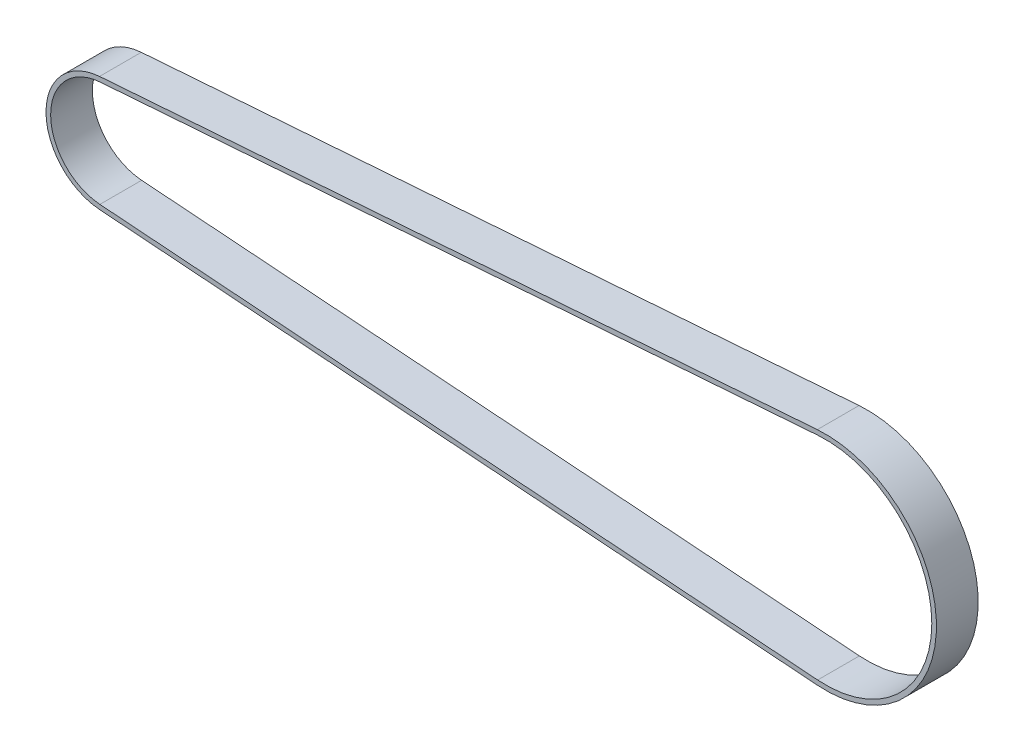
ISO-10303-21;
HEADER;
FILE_DESCRIPTION(('STEP AP214'),'2;1');
FILE_NAME('part.step','',(''),(''),'','','');
FILE_SCHEMA(('AUTOMOTIVE_DESIGN { 1 0 10303 214 1 1 1 1 }'));
ENDSEC;
DATA;
#1=APPLICATION_CONTEXT('core data for automotive mechanical design processes');
#2=APPLICATION_PROTOCOL_DEFINITION('international standard','automotive_design',2000,#1);
#3=PRODUCT_CONTEXT('',#1,'mechanical');
#4=PRODUCT('Part','Part','',(#3));
#5=PRODUCT_RELATED_PRODUCT_CATEGORY('part','',(#4));
#6=PRODUCT_DEFINITION_FORMATION('','',#4);
#7=PRODUCT_DEFINITION_CONTEXT('part definition',#1,'design');
#8=PRODUCT_DEFINITION('design','',#6,#7);
#9=PRODUCT_DEFINITION_SHAPE('','',#8);
#10=(LENGTH_UNIT() NAMED_UNIT(*) SI_UNIT(.MILLI.,.METRE.));
#11=(NAMED_UNIT(*) PLANE_ANGLE_UNIT() SI_UNIT($,.RADIAN.));
#12=(NAMED_UNIT(*) SI_UNIT($,.STERADIAN.) SOLID_ANGLE_UNIT());
#13=UNCERTAINTY_MEASURE_WITH_UNIT(LENGTH_MEASURE(1.E-05),#10,'distance_accuracy_value','');
#14=(GEOMETRIC_REPRESENTATION_CONTEXT(3) GLOBAL_UNCERTAINTY_ASSIGNED_CONTEXT((#13)) GLOBAL_UNIT_ASSIGNED_CONTEXT((#10,
#11,#12)) REPRESENTATION_CONTEXT('',''));
#15=CARTESIAN_POINT('',(0.,0.,0.));
#16=DIRECTION('',(0.,0.,1.));
#17=DIRECTION('',(1.,0.,0.));
#18=AXIS2_PLACEMENT_3D('',#15,#16,#17);
#19=CARTESIAN_POINT('',(-77.7888970641995,0.,9.));
#20=DIRECTION('',(0.,0.,1.));
#21=DIRECTION('',(1.,0.,0.));
#22=AXIS2_PLACEMENT_3D('',#19,#20,#21);
#23=PLANE('',#22);
#24=CARTESIAN_POINT('',(-77.7888970641995,0.,9.));
#25=DIRECTION('',(0.,0.,1.));
#26=DIRECTION('',(1.,0.,0.));
#27=AXIS2_PLACEMENT_3D('',#24,#25,#26);
#28=CIRCLE('',#27,12.4591559026165);
#29=CARTESIAN_POINT('',(-78.7065820764015,12.4253136791021,9.));
#30=VERTEX_POINT('',#29);
#31=CARTESIAN_POINT('',(-78.7065820764015,-12.4253136791021,9.));
#32=VERTEX_POINT('',#31);
#33=EDGE_CURVE('E134',#30,#32,#28,.T.);
#34=ORIENTED_EDGE('',*,*,#33,.T.);
#35=DIRECTION('',(0.997283746685662,-0.0736554722787699,0.));
#36=VECTOR('',#35,1.);
#37=CARTESIAN_POINT('',(76.0271825120742,-23.8533436115186,9.));
#38=LINE('',#37,#36);
#39=CARTESIAN_POINT('',(76.0271825120742,-23.8533436115186,9.));
#40=VERTEX_POINT('',#39);
#41=EDGE_CURVE('E137',#32,#40,#38,.T.);
#42=ORIENTED_EDGE('',*,*,#41,.T.);
#43=CARTESIAN_POINT('',(77.7888970641995,0.,9.));
#44=DIRECTION('',(0.,0.,1.));
#45=DIRECTION('',(1.,0.,0.));
#46=AXIS2_PLACEMENT_3D('',#43,#44,#45);
#47=CIRCLE('',#46,23.9183118052329);
#48=CARTESIAN_POINT('',(76.0271825120742,23.8533436115186,9.));
#49=VERTEX_POINT('',#48);
#50=EDGE_CURVE('E140',#40,#49,#47,.T.);
#51=ORIENTED_EDGE('',*,*,#50,.T.);
#52=DIRECTION('',(-0.997283746685662,-0.0736554722787699,0.));
#53=VECTOR('',#52,1.);
#54=CARTESIAN_POINT('',(-78.7065820764015,12.4253136791021,9.));
#55=LINE('',#54,#53);
#56=EDGE_CURVE('E142',#49,#30,#55,.T.);
#57=ORIENTED_EDGE('',*,*,#56,.T.);
#58=EDGE_LOOP('',(#34,#42,#51,#57));
#59=FACE_BOUND('',#58,.T.);
#60=DIRECTION('',(0.997283746685662,-0.0736554722787699,0.));
#61=VECTOR('',#60,1.);
#62=CARTESIAN_POINT('',(76.100837984353,-22.8560598648329,9.));
#63=LINE('',#62,#61);
#64=CARTESIAN_POINT('',(-78.6329266041228,-11.4280299324165,9.));
#65=VERTEX_POINT('',#64);
#66=CARTESIAN_POINT('',(76.1008379843529,-22.8560598648329,9.));
#67=VERTEX_POINT('',#66);
#68=EDGE_CURVE('E106',#65,#67,#63,.T.);
#69=ORIENTED_EDGE('',*,*,#68,.F.);
#70=CARTESIAN_POINT('',(-77.7888970641995,0.,9.));
#71=DIRECTION('',(0.,0.,1.));
#72=DIRECTION('',(1.,0.,0.));
#73=AXIS2_PLACEMENT_3D('',#70,#71,#72);
#74=CIRCLE('',#73,11.4591559026165);
#75=CARTESIAN_POINT('',(-78.6329266041228,11.4280299324165,9.));
#76=VERTEX_POINT('',#75);
#77=EDGE_CURVE('E98',#76,#65,#74,.T.);
#78=ORIENTED_EDGE('',*,*,#77,.F.);
#79=DIRECTION('',(-0.997283746685662,-0.0736554722787699,0.));
#80=VECTOR('',#79,1.);
#81=CARTESIAN_POINT('',(-78.6329266041228,11.4280299324165,9.));
#82=LINE('',#81,#80);
#83=CARTESIAN_POINT('',(76.1008379843529,22.8560598648329,9.));
#84=VERTEX_POINT('',#83);
#85=EDGE_CURVE('E120',#84,#76,#82,.T.);
#86=ORIENTED_EDGE('',*,*,#85,.F.);
#87=CARTESIAN_POINT('',(77.7888970641995,0.,9.));
#88=DIRECTION('',(0.,0.,1.));
#89=DIRECTION('',(1.,0.,0.));
#90=AXIS2_PLACEMENT_3D('',#87,#88,#89);
#91=CIRCLE('',#90,22.9183118052329);
#92=EDGE_CURVE('E118',#67,#84,#91,.T.);
#93=ORIENTED_EDGE('',*,*,#92,.F.);
#94=EDGE_LOOP('',(#69,#78,#86,#93));
#95=FACE_BOUND('',#94,.T.);
#96=ADVANCED_FACE('F33',(#59,#95),#23,.T.);
#97=CARTESIAN_POINT('',(-77.7888970641995,0.,0.));
#98=DIRECTION('',(0.,0.,1.));
#99=DIRECTION('',(1.,0.,0.));
#100=AXIS2_PLACEMENT_3D('',#97,#98,#99);
#101=PLANE('',#100);
#102=CARTESIAN_POINT('',(-77.7888970641995,0.,0.));
#103=DIRECTION('',(0.,0.,1.));
#104=DIRECTION('',(1.,0.,0.));
#105=AXIS2_PLACEMENT_3D('',#102,#103,#104);
#106=CIRCLE('',#105,12.4591559026165);
#107=CARTESIAN_POINT('',(-78.7065820764015,12.4253136791021,0.));
#108=VERTEX_POINT('',#107);
#109=CARTESIAN_POINT('',(-78.7065820764015,-12.4253136791021,0.));
#110=VERTEX_POINT('',#109);
#111=EDGE_CURVE('E114',#108,#110,#106,.T.);
#112=ORIENTED_EDGE('',*,*,#111,.F.);
#113=DIRECTION('',(-0.997283746685662,-0.0736554722787699,0.));
#114=VECTOR('',#113,1.);
#115=CARTESIAN_POINT('',(-78.7065820764015,12.4253136791021,0.));
#116=LINE('',#115,#114);
#117=CARTESIAN_POINT('',(76.0271825120742,23.8533436115186,0.));
#118=VERTEX_POINT('',#117);
#119=EDGE_CURVE('E138',#118,#108,#116,.T.);
#120=ORIENTED_EDGE('',*,*,#119,.F.);
#121=CARTESIAN_POINT('',(77.7888970641995,0.,0.));
#122=DIRECTION('',(0.,0.,1.));
#123=DIRECTION('',(1.,0.,0.));
#124=AXIS2_PLACEMENT_3D('',#121,#122,#123);
#125=CIRCLE('',#124,23.9183118052329);
#126=CARTESIAN_POINT('',(76.0271825120742,-23.8533436115186,0.));
#127=VERTEX_POINT('',#126);
#128=EDGE_CURVE('E149',#127,#118,#125,.T.);
#129=ORIENTED_EDGE('',*,*,#128,.F.);
#130=DIRECTION('',(0.997283746685662,-0.0736554722787699,0.));
#131=VECTOR('',#130,1.);
#132=CARTESIAN_POINT('',(76.0271825120742,-23.8533436115186,0.));
#133=LINE('',#132,#131);
#134=EDGE_CURVE('E147',#110,#127,#133,.T.);
#135=ORIENTED_EDGE('',*,*,#134,.F.);
#136=EDGE_LOOP('',(#112,#120,#129,#135));
#137=FACE_BOUND('',#136,.T.);
#138=CARTESIAN_POINT('',(-77.7888970641995,0.,0.));
#139=DIRECTION('',(0.,0.,1.));
#140=DIRECTION('',(1.,0.,0.));
#141=AXIS2_PLACEMENT_3D('',#138,#139,#140);
#142=CIRCLE('',#141,11.4591559026165);
#143=CARTESIAN_POINT('',(-78.6329266041228,11.4280299324165,0.));
#144=VERTEX_POINT('',#143);
#145=CARTESIAN_POINT('',(-78.6329266041228,-11.4280299324165,0.));
#146=VERTEX_POINT('',#145);
#147=EDGE_CURVE('E56',#144,#146,#142,.T.);
#148=ORIENTED_EDGE('',*,*,#147,.T.);
#149=DIRECTION('',(0.997283746685662,-0.0736554722787699,0.));
#150=VECTOR('',#149,1.);
#151=CARTESIAN_POINT('',(76.100837984353,-22.8560598648329,0.));
#152=LINE('',#151,#150);
#153=CARTESIAN_POINT('',(76.1008379843529,-22.8560598648329,0.));
#154=VERTEX_POINT('',#153);
#155=EDGE_CURVE('E113',#146,#154,#152,.T.);
#156=ORIENTED_EDGE('',*,*,#155,.T.);
#157=CARTESIAN_POINT('',(77.7888970641995,0.,0.));
#158=DIRECTION('',(0.,0.,1.));
#159=DIRECTION('',(1.,0.,0.));
#160=AXIS2_PLACEMENT_3D('',#157,#158,#159);
#161=CIRCLE('',#160,22.9183118052329);
#162=CARTESIAN_POINT('',(76.100837984353,22.8560598648329,0.));
#163=VERTEX_POINT('',#162);
#164=EDGE_CURVE('E126',#154,#163,#161,.T.);
#165=ORIENTED_EDGE('',*,*,#164,.T.);
#166=DIRECTION('',(-0.997283746685662,-0.0736554722787699,0.));
#167=VECTOR('',#166,1.);
#168=CARTESIAN_POINT('',(-78.6329266041228,11.4280299324165,0.));
#169=LINE('',#168,#167);
#170=EDGE_CURVE('E107',#163,#144,#169,.T.);
#171=ORIENTED_EDGE('',*,*,#170,.T.);
#172=EDGE_LOOP('',(#148,#156,#165,#171));
#173=FACE_BOUND('',#172,.T.);
#174=ADVANCED_FACE('F167',(#137,#173),#101,.F.);
#175=CARTESIAN_POINT('',(-77.7888970641995,0.,9.));
#176=DIRECTION('',(0.,0.,-1.));
#177=DIRECTION('',(-1.,0.,0.));
#178=AXIS2_PLACEMENT_3D('',#175,#176,#177);
#179=CYLINDRICAL_SURFACE('',#178,12.4591559026165);
#180=ORIENTED_EDGE('',*,*,#111,.T.);
#181=DIRECTION('',(0.,0.,-1.));
#182=VECTOR('',#181,1.);
#183=CARTESIAN_POINT('',(-78.7065820764015,-12.4253136791021,9.));
#184=LINE('',#183,#182);
#185=EDGE_CURVE('E11',#32,#110,#184,.T.);
#186=ORIENTED_EDGE('',*,*,#185,.F.);
#187=ORIENTED_EDGE('',*,*,#33,.F.);
#188=DIRECTION('',(0.,0.,-1.));
#189=VECTOR('',#188,1.);
#190=CARTESIAN_POINT('',(-78.7065820764015,12.4253136791021,9.));
#191=LINE('',#190,#189);
#192=EDGE_CURVE('E144',#30,#108,#191,.T.);
#193=ORIENTED_EDGE('',*,*,#192,.T.);
#194=EDGE_LOOP('',(#180,#186,#187,#193));
#195=FACE_BOUND('',#194,.T.);
#196=ADVANCED_FACE('F35',(#195),#179,.T.);
#197=CARTESIAN_POINT('',(76.0271825120742,-23.8533436115186,9.));
#198=DIRECTION('',(0.0736554722787699,0.997283746685662,0.));
#199=DIRECTION('',(-0.997283746685662,0.0736554722787699,0.));
#200=AXIS2_PLACEMENT_3D('',#197,#198,#199);
#201=PLANE('',#200);
#202=ORIENTED_EDGE('',*,*,#134,.T.);
#203=DIRECTION('',(0.,0.,-1.));
#204=VECTOR('',#203,1.);
#205=CARTESIAN_POINT('',(76.0271825120742,-23.8533436115186,9.));
#206=LINE('',#205,#204);
#207=EDGE_CURVE('E41',#40,#127,#206,.T.);
#208=ORIENTED_EDGE('',*,*,#207,.F.);
#209=ORIENTED_EDGE('',*,*,#41,.F.);
#210=ORIENTED_EDGE('',*,*,#185,.T.);
#211=EDGE_LOOP('',(#202,#208,#209,#210));
#212=FACE_BOUND('',#211,.T.);
#213=ADVANCED_FACE('F177',(#212),#201,.F.);
#214=CARTESIAN_POINT('',(77.7888970641995,0.,9.));
#215=DIRECTION('',(0.,0.,-1.));
#216=DIRECTION('',(-1.,0.,0.));
#217=AXIS2_PLACEMENT_3D('',#214,#215,#216);
#218=CYLINDRICAL_SURFACE('',#217,23.9183118052329);
#219=ORIENTED_EDGE('',*,*,#128,.T.);
#220=DIRECTION('',(0.,0.,-1.));
#221=VECTOR('',#220,1.);
#222=CARTESIAN_POINT('',(76.0271825120742,23.8533436115186,9.));
#223=LINE('',#222,#221);
#224=EDGE_CURVE('E154',#49,#118,#223,.T.);
#225=ORIENTED_EDGE('',*,*,#224,.F.);
#226=ORIENTED_EDGE('',*,*,#50,.F.);
#227=ORIENTED_EDGE('',*,*,#207,.T.);
#228=EDGE_LOOP('',(#219,#225,#226,#227));
#229=FACE_BOUND('',#228,.T.);
#230=ADVANCED_FACE('F161',(#229),#218,.T.);
#231=CARTESIAN_POINT('',(-78.7065820764015,12.4253136791021,9.));
#232=DIRECTION('',(0.0736554722787699,-0.997283746685662,0.));
#233=DIRECTION('',(0.997283746685662,0.0736554722787699,0.));
#234=AXIS2_PLACEMENT_3D('',#231,#232,#233);
#235=PLANE('',#234);
#236=ORIENTED_EDGE('',*,*,#119,.T.);
#237=ORIENTED_EDGE('',*,*,#192,.F.);
#238=ORIENTED_EDGE('',*,*,#56,.F.);
#239=ORIENTED_EDGE('',*,*,#224,.T.);
#240=EDGE_LOOP('',(#236,#237,#238,#239));
#241=FACE_BOUND('',#240,.T.);
#242=ADVANCED_FACE('F171',(#241),#235,.F.);
#243=CARTESIAN_POINT('',(-77.7888970641995,0.,9.));
#244=DIRECTION('',(0.,0.,-1.));
#245=DIRECTION('',(-1.,0.,0.));
#246=AXIS2_PLACEMENT_3D('',#243,#244,#245);
#247=CYLINDRICAL_SURFACE('',#246,11.4591559026165);
#248=ORIENTED_EDGE('',*,*,#147,.F.);
#249=DIRECTION('',(0.,0.,-1.));
#250=VECTOR('',#249,1.);
#251=CARTESIAN_POINT('',(-78.6329266041228,11.4280299324165,9.));
#252=LINE('',#251,#250);
#253=EDGE_CURVE('E102',#76,#144,#252,.T.);
#254=ORIENTED_EDGE('',*,*,#253,.F.);
#255=ORIENTED_EDGE('',*,*,#77,.T.);
#256=DIRECTION('',(0.,0.,-1.));
#257=VECTOR('',#256,1.);
#258=CARTESIAN_POINT('',(-78.6329266041228,-11.4280299324165,9.));
#259=LINE('',#258,#257);
#260=EDGE_CURVE('E101',#65,#146,#259,.T.);
#261=ORIENTED_EDGE('',*,*,#260,.T.);
#262=EDGE_LOOP('',(#248,#254,#255,#261));
#263=FACE_BOUND('',#262,.T.);
#264=ADVANCED_FACE('F100',(#263),#247,.F.);
#265=CARTESIAN_POINT('',(76.100837984353,-22.8560598648329,9.));
#266=DIRECTION('',(0.0736554722787699,0.997283746685662,0.));
#267=DIRECTION('',(-0.997283746685662,0.0736554722787699,0.));
#268=AXIS2_PLACEMENT_3D('',#265,#266,#267);
#269=PLANE('',#268);
#270=ORIENTED_EDGE('',*,*,#155,.F.);
#271=ORIENTED_EDGE('',*,*,#260,.F.);
#272=ORIENTED_EDGE('',*,*,#68,.T.);
#273=DIRECTION('',(0.,0.,-1.));
#274=VECTOR('',#273,1.);
#275=CARTESIAN_POINT('',(76.1008379843529,-22.8560598648329,9.));
#276=LINE('',#275,#274);
#277=EDGE_CURVE('E115',#67,#154,#276,.T.);
#278=ORIENTED_EDGE('',*,*,#277,.T.);
#279=EDGE_LOOP('',(#270,#271,#272,#278));
#280=FACE_BOUND('',#279,.T.);
#281=ADVANCED_FACE('F110',(#280),#269,.T.);
#282=CARTESIAN_POINT('',(77.7888970641995,0.,9.));
#283=DIRECTION('',(0.,0.,-1.));
#284=DIRECTION('',(-1.,0.,0.));
#285=AXIS2_PLACEMENT_3D('',#282,#283,#284);
#286=CYLINDRICAL_SURFACE('',#285,22.9183118052329);
#287=ORIENTED_EDGE('',*,*,#164,.F.);
#288=ORIENTED_EDGE('',*,*,#277,.F.);
#289=ORIENTED_EDGE('',*,*,#92,.T.);
#290=DIRECTION('',(0.,0.,-1.));
#291=VECTOR('',#290,1.);
#292=CARTESIAN_POINT('',(76.100837984353,22.8560598648329,9.));
#293=LINE('',#292,#291);
#294=EDGE_CURVE('E48',#84,#163,#293,.T.);
#295=ORIENTED_EDGE('',*,*,#294,.T.);
#296=EDGE_LOOP('',(#287,#288,#289,#295));
#297=FACE_BOUND('',#296,.T.);
#298=ADVANCED_FACE('F200',(#297),#286,.F.);
#299=CARTESIAN_POINT('',(-78.6329266041228,11.4280299324165,9.));
#300=DIRECTION('',(0.0736554722787699,-0.997283746685662,0.));
#301=DIRECTION('',(0.997283746685662,0.0736554722787699,0.));
#302=AXIS2_PLACEMENT_3D('',#299,#300,#301);
#303=PLANE('',#302);
#304=ORIENTED_EDGE('',*,*,#170,.F.);
#305=ORIENTED_EDGE('',*,*,#294,.F.);
#306=ORIENTED_EDGE('',*,*,#85,.T.);
#307=ORIENTED_EDGE('',*,*,#253,.T.);
#308=EDGE_LOOP('',(#304,#305,#306,#307));
#309=FACE_BOUND('',#308,.T.);
#310=ADVANCED_FACE('F204',(#309),#303,.T.);
#311=CLOSED_SHELL('',(#96,#174,#196,#213,#230,#242,#264,#281,#298,#310));
#312=MANIFOLD_SOLID_BREP('B2',#311);
#313=ADVANCED_BREP_SHAPE_REPRESENTATION('',(#18,#312),#14);
#314=SHAPE_DEFINITION_REPRESENTATION(#9,#313);
ENDSEC;
END-ISO-10303-21;
